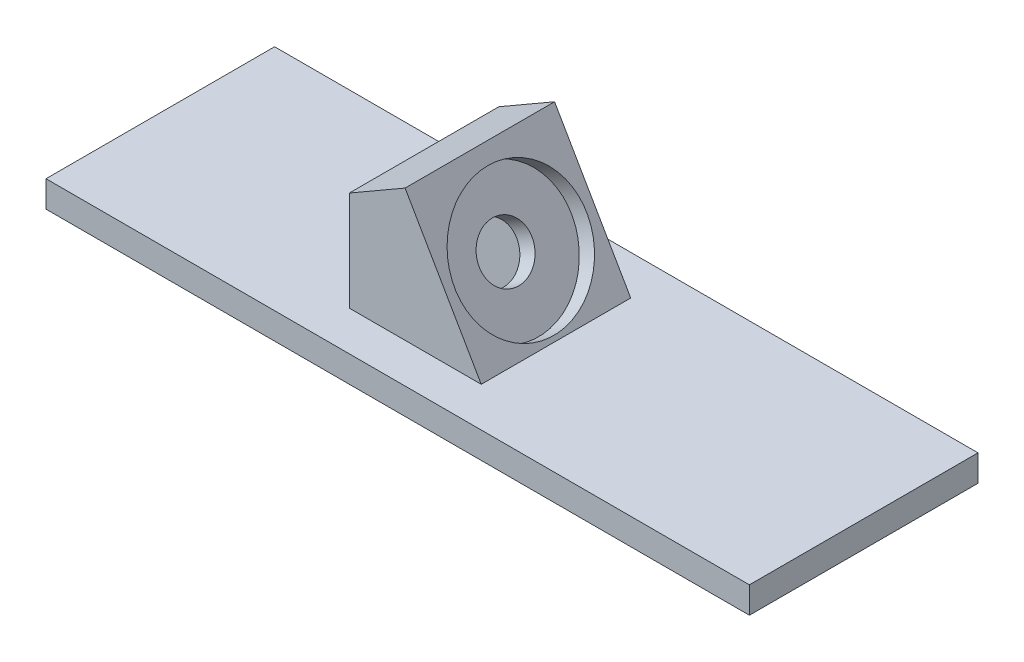
ISO-10303-21;
HEADER;
FILE_DESCRIPTION(('STEP AP214'),'2;1');
FILE_NAME('part.step','',(''),(''),'','','');
FILE_SCHEMA(('AUTOMOTIVE_DESIGN { 1 0 10303 214 1 1 1 1 }'));
ENDSEC;
DATA;
#1=APPLICATION_CONTEXT('core data for automotive mechanical design processes');
#2=APPLICATION_PROTOCOL_DEFINITION('international standard','automotive_design',2000,#1);
#3=PRODUCT_CONTEXT('',#1,'mechanical');
#4=PRODUCT('Part','Part','',(#3));
#5=PRODUCT_RELATED_PRODUCT_CATEGORY('part','',(#4));
#6=PRODUCT_DEFINITION_FORMATION('','',#4);
#7=PRODUCT_DEFINITION_CONTEXT('part definition',#1,'design');
#8=PRODUCT_DEFINITION('design','',#6,#7);
#9=PRODUCT_DEFINITION_SHAPE('','',#8);
#10=(LENGTH_UNIT() NAMED_UNIT(*) SI_UNIT(.MILLI.,.METRE.));
#11=(NAMED_UNIT(*) PLANE_ANGLE_UNIT() SI_UNIT($,.RADIAN.));
#12=(NAMED_UNIT(*) SI_UNIT($,.STERADIAN.) SOLID_ANGLE_UNIT());
#13=UNCERTAINTY_MEASURE_WITH_UNIT(LENGTH_MEASURE(1.E-05),#10,'distance_accuracy_value','');
#14=(GEOMETRIC_REPRESENTATION_CONTEXT(3) GLOBAL_UNCERTAINTY_ASSIGNED_CONTEXT((#13)) GLOBAL_UNIT_ASSIGNED_CONTEXT((#10,
#11,#12)) REPRESENTATION_CONTEXT('',''));
#15=CARTESIAN_POINT('',(0.,0.,0.));
#16=DIRECTION('',(0.,0.,1.));
#17=DIRECTION('',(1.,0.,0.));
#18=AXIS2_PLACEMENT_3D('',#15,#16,#17);
#19=CARTESIAN_POINT('',(0.,15.,0.));
#20=DIRECTION('',(0.,1.,0.));
#21=DIRECTION('',(0.,0.,1.));
#22=AXIS2_PLACEMENT_3D('',#19,#20,#21);
#23=PLANE('',#22);
#24=DIRECTION('',(-1.,0.,0.));
#25=VECTOR('',#24,1.);
#26=CARTESIAN_POINT('',(0.,15.,-11.4479067731796));
#27=LINE('',#26,#25);
#28=CARTESIAN_POINT('',(9.63307260253866,15.,-11.4479067731796));
#29=VERTEX_POINT('',#28);
#30=CARTESIAN_POINT('',(9.62196560360838,15.,-11.4479067731796));
#31=VERTEX_POINT('',#30);
#32=EDGE_CURVE('E194',#29,#31,#27,.T.);
#33=ORIENTED_EDGE('',*,*,#32,.F.);
#34=DIRECTION('',(0.,0.,1.));
#35=VECTOR('',#34,1.);
#36=CARTESIAN_POINT('',(9.63307260253866,15.,-15.6979067731796));
#37=LINE('',#36,#35);
#38=CARTESIAN_POINT('',(9.63307260253866,15.,-15.6979067731796));
#39=VERTEX_POINT('',#38);
#40=EDGE_CURVE('E218',#39,#29,#37,.T.);
#41=ORIENTED_EDGE('',*,*,#40,.F.);
#42=DIRECTION('',(-1.,0.,0.));
#43=VECTOR('',#42,1.);
#44=CARTESIAN_POINT('',(9.63307260253866,15.,-15.6979067731796));
#45=LINE('',#44,#43);
#46=CARTESIAN_POINT('',(24.6330726025387,15.,-15.6979067731796));
#47=VERTEX_POINT('',#46);
#48=EDGE_CURVE('E224',#47,#39,#45,.T.);
#49=ORIENTED_EDGE('',*,*,#48,.F.);
#50=DIRECTION('',(0.,0.,-1.));
#51=VECTOR('',#50,1.);
#52=CARTESIAN_POINT('',(24.6330726025387,15.,-15.6979067731796));
#53=LINE('',#52,#51);
#54=CARTESIAN_POINT('',(24.6330726025387,15.,1.30209322682037));
#55=VERTEX_POINT('',#54);
#56=EDGE_CURVE('E170',#55,#47,#53,.T.);
#57=ORIENTED_EDGE('',*,*,#56,.F.);
#58=DIRECTION('',(1.,0.,0.));
#59=VECTOR('',#58,1.);
#60=CARTESIAN_POINT('',(9.63307260253866,15.,1.30209322682037));
#61=LINE('',#60,#59);
#62=CARTESIAN_POINT('',(9.63307260253866,15.,1.30209322682037));
#63=VERTEX_POINT('',#62);
#64=EDGE_CURVE('E221',#63,#55,#61,.T.);
#65=ORIENTED_EDGE('',*,*,#64,.F.);
#66=CARTESIAN_POINT('',(9.63307260253866,15.,-2.94790677317963));
#67=VERTEX_POINT('',#66);
#68=EDGE_CURVE('E215',#67,#63,#37,.T.);
#69=ORIENTED_EDGE('',*,*,#68,.F.);
#70=DIRECTION('',(1.,0.,0.));
#71=VECTOR('',#70,1.);
#72=CARTESIAN_POINT('',(0.,15.,-2.94790677317963));
#73=LINE('',#72,#71);
#74=CARTESIAN_POINT('',(9.62196560360838,15.,-2.94790677317963));
#75=VERTEX_POINT('',#74);
#76=EDGE_CURVE('E519',#75,#67,#73,.T.);
#77=ORIENTED_EDGE('',*,*,#76,.F.);
#78=DIRECTION('',(0.,0.,-1.));
#79=VECTOR('',#78,1.);
#80=CARTESIAN_POINT('',(9.62196560360838,15.,0.));
#81=LINE('',#80,#79);
#82=EDGE_CURVE('E201',#75,#31,#81,.T.);
#83=ORIENTED_EDGE('',*,*,#82,.T.);
#84=EDGE_LOOP('',(#33,#41,#49,#57,#65,#69,#77,#83));
#85=FACE_BOUND('',#84,.T.);
#86=DIRECTION('',(0.,0.,1.));
#87=VECTOR('',#86,1.);
#88=CARTESIAN_POINT('',(-20.3669273974613,15.,-20.1979067731796));
#89=LINE('',#88,#87);
#90=CARTESIAN_POINT('',(-20.3669273974613,15.,-20.1979067731796));
#91=VERTEX_POINT('',#90);
#92=CARTESIAN_POINT('',(-20.3669273974613,15.,5.80209317830769));
#93=VERTEX_POINT('',#92);
#94=EDGE_CURVE('E230',#91,#93,#89,.T.);
#95=ORIENTED_EDGE('',*,*,#94,.T.);
#96=DIRECTION('',(1.,0.,0.));
#97=VECTOR('',#96,1.);
#98=CARTESIAN_POINT('',(-20.3669273974613,15.,5.80209317830769));
#99=LINE('',#98,#97);
#100=CARTESIAN_POINT('',(59.6315787523036,15.,5.80209317830769));
#101=VERTEX_POINT('',#100);
#102=EDGE_CURVE('E233',#93,#101,#99,.T.);
#103=ORIENTED_EDGE('',*,*,#102,.T.);
#104=DIRECTION('',(0.,0.,-1.));
#105=VECTOR('',#104,1.);
#106=CARTESIAN_POINT('',(59.6315787523036,15.,-20.1979067731796));
#107=LINE('',#106,#105);
#108=CARTESIAN_POINT('',(59.6315787523036,15.,-20.1979067731796));
#109=VERTEX_POINT('',#108);
#110=EDGE_CURVE('E236',#101,#109,#107,.T.);
#111=ORIENTED_EDGE('',*,*,#110,.T.);
#112=DIRECTION('',(-1.,0.,0.));
#113=VECTOR('',#112,1.);
#114=CARTESIAN_POINT('',(-20.3669273974613,15.,-20.1979067731796));
#115=LINE('',#114,#113);
#116=EDGE_CURVE('E238',#109,#91,#115,.T.);
#117=ORIENTED_EDGE('',*,*,#116,.T.);
#118=EDGE_LOOP('',(#95,#103,#111,#117));
#119=FACE_BOUND('',#118,.T.);
#120=ADVANCED_FACE('F33',(#85,#119),#23,.T.);
#121=CARTESIAN_POINT('',(0.,12.,0.));
#122=DIRECTION('',(0.,1.,0.));
#123=DIRECTION('',(0.,0.,1.));
#124=AXIS2_PLACEMENT_3D('',#121,#122,#123);
#125=PLANE('',#124);
#126=DIRECTION('',(0.,0.,-1.));
#127=VECTOR('',#126,1.);
#128=CARTESIAN_POINT('',(59.6315787523036,12.,-20.1979067731796));
#129=LINE('',#128,#127);
#130=CARTESIAN_POINT('',(59.6315787523036,12.,5.80209317830769));
#131=VERTEX_POINT('',#130);
#132=CARTESIAN_POINT('',(59.6315787523036,12.,-20.1979067731796));
#133=VERTEX_POINT('',#132);
#134=EDGE_CURVE('E244',#131,#133,#129,.T.);
#135=ORIENTED_EDGE('',*,*,#134,.F.);
#136=DIRECTION('',(1.,0.,0.));
#137=VECTOR('',#136,1.);
#138=CARTESIAN_POINT('',(-20.3669273974613,12.,5.80209317830769));
#139=LINE('',#138,#137);
#140=CARTESIAN_POINT('',(-20.3669273974613,12.,5.80209317830769));
#141=VERTEX_POINT('',#140);
#142=EDGE_CURVE('E242',#141,#131,#139,.T.);
#143=ORIENTED_EDGE('',*,*,#142,.F.);
#144=DIRECTION('',(0.,0.,1.));
#145=VECTOR('',#144,1.);
#146=CARTESIAN_POINT('',(-20.3669273974613,12.,-20.1979067731796));
#147=LINE('',#146,#145);
#148=CARTESIAN_POINT('',(-20.3669273974613,12.,-20.1979067731796));
#149=VERTEX_POINT('',#148);
#150=EDGE_CURVE('E229',#149,#141,#147,.T.);
#151=ORIENTED_EDGE('',*,*,#150,.F.);
#152=DIRECTION('',(-1.,0.,0.));
#153=VECTOR('',#152,1.);
#154=CARTESIAN_POINT('',(-20.3669273974613,12.,-20.1979067731796));
#155=LINE('',#154,#153);
#156=EDGE_CURVE('E234',#133,#149,#155,.T.);
#157=ORIENTED_EDGE('',*,*,#156,.F.);
#158=EDGE_LOOP('',(#135,#143,#151,#157));
#159=FACE_BOUND('',#158,.T.);
#160=DIRECTION('',(0.,0.,-1.));
#161=VECTOR('',#160,1.);
#162=CARTESIAN_POINT('',(21.7463212565905,12.,0.));
#163=LINE('',#162,#161);
#164=CARTESIAN_POINT('',(21.7463212565905,12.,-2.95726958175604));
#165=VERTEX_POINT('',#164);
#166=CARTESIAN_POINT('',(21.7463212565905,12.,-11.4479067731796));
#167=VERTEX_POINT('',#166);
#168=EDGE_CURVE('E200',#165,#167,#163,.T.);
#169=ORIENTED_EDGE('',*,*,#168,.T.);
#170=DIRECTION('',(-1.,0.,0.));
#171=VECTOR('',#170,1.);
#172=CARTESIAN_POINT('',(0.,12.,-11.4479067731796));
#173=LINE('',#172,#171);
#174=CARTESIAN_POINT('',(11.3540164111772,12.,-11.4479067731796));
#175=VERTEX_POINT('',#174);
#176=EDGE_CURVE('E191',#167,#175,#173,.T.);
#177=ORIENTED_EDGE('',*,*,#176,.T.);
#178=DIRECTION('',(0.,0.,-1.));
#179=VECTOR('',#178,1.);
#180=CARTESIAN_POINT('',(11.3540164111772,12.,0.));
#181=LINE('',#180,#179);
#182=CARTESIAN_POINT('',(11.3540164111772,12.,-2.94790677317963));
#183=VERTEX_POINT('',#182);
#184=EDGE_CURVE('E41',#183,#175,#181,.T.);
#185=ORIENTED_EDGE('',*,*,#184,.F.);
#186=DIRECTION('',(1.,0.,0.));
#187=VECTOR('',#186,1.);
#188=CARTESIAN_POINT('',(0.,12.,-2.94790677317963));
#189=LINE('',#188,#187);
#190=CARTESIAN_POINT('',(11.936920179832,12.,-2.94790677317963));
#191=VERTEX_POINT('',#190);
#192=EDGE_CURVE('E205',#183,#191,#189,.T.);
#193=ORIENTED_EDGE('',*,*,#192,.T.);
#194=DIRECTION('',(0.,0.,-1.));
#195=VECTOR('',#194,1.);
#196=CARTESIAN_POINT('',(11.936920179832,12.,0.));
#197=LINE('',#196,#195);
#198=CARTESIAN_POINT('',(11.936920179832,12.,-2.95726958175604));
#199=VERTEX_POINT('',#198);
#200=EDGE_CURVE('E11',#191,#199,#197,.T.);
#201=ORIENTED_EDGE('',*,*,#200,.T.);
#202=DIRECTION('',(1.,0.,0.));
#203=VECTOR('',#202,1.);
#204=CARTESIAN_POINT('',(0.,12.,-2.95726958175604));
#205=LINE('',#204,#203);
#206=EDGE_CURVE('E502',#199,#165,#205,.T.);
#207=ORIENTED_EDGE('',*,*,#206,.T.);
#208=EDGE_LOOP('',(#169,#177,#185,#193,#201,#207));
#209=FACE_BOUND('',#208,.T.);
#210=ADVANCED_FACE('F198',(#159,#209),#125,.F.);
#211=CARTESIAN_POINT('',(-20.3669273974613,15.,-20.1979067731796));
#212=DIRECTION('',(1.,0.,0.));
#213=DIRECTION('',(0.,0.,-1.));
#214=AXIS2_PLACEMENT_3D('',#211,#212,#213);
#215=PLANE('',#214);
#216=ORIENTED_EDGE('',*,*,#150,.T.);
#217=DIRECTION('',(0.,-1.,0.));
#218=VECTOR('',#217,1.);
#219=CARTESIAN_POINT('',(-20.3669273974613,15.,5.80209317830769));
#220=LINE('',#219,#218);
#221=EDGE_CURVE('E158',#93,#141,#220,.T.);
#222=ORIENTED_EDGE('',*,*,#221,.F.);
#223=ORIENTED_EDGE('',*,*,#94,.F.);
#224=DIRECTION('',(0.,-1.,0.));
#225=VECTOR('',#224,1.);
#226=CARTESIAN_POINT('',(-20.3669273974613,15.,-20.1979067731796));
#227=LINE('',#226,#225);
#228=EDGE_CURVE('E240',#91,#149,#227,.T.);
#229=ORIENTED_EDGE('',*,*,#228,.T.);
#230=EDGE_LOOP('',(#216,#222,#223,#229));
#231=FACE_BOUND('',#230,.T.);
#232=ADVANCED_FACE('F262',(#231),#215,.F.);
#233=CARTESIAN_POINT('',(-20.3669273974613,15.,5.80209317830769));
#234=DIRECTION('',(0.,0.,-1.));
#235=DIRECTION('',(-1.,0.,0.));
#236=AXIS2_PLACEMENT_3D('',#233,#234,#235);
#237=PLANE('',#236);
#238=ORIENTED_EDGE('',*,*,#142,.T.);
#239=DIRECTION('',(0.,-1.,0.));
#240=VECTOR('',#239,1.);
#241=CARTESIAN_POINT('',(59.6315787523036,15.,5.80209317830769));
#242=LINE('',#241,#240);
#243=EDGE_CURVE('E252',#101,#131,#242,.T.);
#244=ORIENTED_EDGE('',*,*,#243,.F.);
#245=ORIENTED_EDGE('',*,*,#102,.F.);
#246=ORIENTED_EDGE('',*,*,#221,.T.);
#247=EDGE_LOOP('',(#238,#244,#245,#246));
#248=FACE_BOUND('',#247,.T.);
#249=ADVANCED_FACE('F257',(#248),#237,.F.);
#250=CARTESIAN_POINT('',(59.6315787523036,15.,-20.1979067731796));
#251=DIRECTION('',(-1.,0.,0.));
#252=DIRECTION('',(0.,0.,1.));
#253=AXIS2_PLACEMENT_3D('',#250,#251,#252);
#254=PLANE('',#253);
#255=ORIENTED_EDGE('',*,*,#134,.T.);
#256=DIRECTION('',(0.,-1.,0.));
#257=VECTOR('',#256,1.);
#258=CARTESIAN_POINT('',(59.6315787523036,15.,-20.1979067731796));
#259=LINE('',#258,#257);
#260=EDGE_CURVE('E249',#109,#133,#259,.T.);
#261=ORIENTED_EDGE('',*,*,#260,.F.);
#262=ORIENTED_EDGE('',*,*,#110,.F.);
#263=ORIENTED_EDGE('',*,*,#243,.T.);
#264=EDGE_LOOP('',(#255,#261,#262,#263));
#265=FACE_BOUND('',#264,.T.);
#266=ADVANCED_FACE('F270',(#265),#254,.F.);
#267=CARTESIAN_POINT('',(-20.3669273974613,15.,-20.1979067731796));
#268=DIRECTION('',(0.,0.,1.));
#269=DIRECTION('',(1.,0.,0.));
#270=AXIS2_PLACEMENT_3D('',#267,#268,#269);
#271=PLANE('',#270);
#272=ORIENTED_EDGE('',*,*,#156,.T.);
#273=ORIENTED_EDGE('',*,*,#228,.F.);
#274=ORIENTED_EDGE('',*,*,#116,.F.);
#275=ORIENTED_EDGE('',*,*,#260,.T.);
#276=EDGE_LOOP('',(#272,#273,#274,#275));
#277=FACE_BOUND('',#276,.T.);
#278=ADVANCED_FACE('F274',(#277),#271,.F.);
#279=CARTESIAN_POINT('',(9.63307260253866,30.,-15.6979067731796));
#280=DIRECTION('',(1.,0.,0.));
#281=DIRECTION('',(0.,0.,-1.));
#282=AXIS2_PLACEMENT_3D('',#279,#280,#281);
#283=PLANE('',#282);
#284=DIRECTION('',(0.,-1.,0.));
#285=VECTOR('',#284,1.);
#286=CARTESIAN_POINT('',(9.63307260253866,30.,1.30209322682037));
#287=LINE('',#286,#285);
#288=CARTESIAN_POINT('',(9.63307260253866,26.3397459621556,1.30209322682037));
#289=VERTEX_POINT('',#288);
#290=EDGE_CURVE('E227',#289,#63,#287,.T.);
#291=ORIENTED_EDGE('',*,*,#290,.F.);
#292=DIRECTION('',(0.,0.,-1.));
#293=VECTOR('',#292,1.);
#294=CARTESIAN_POINT('',(9.63307260253866,26.3397459621556,-15.6979067731796));
#295=LINE('',#294,#293);
#296=CARTESIAN_POINT('',(9.63307260253866,26.3397459621556,-15.6979067731796));
#297=VERTEX_POINT('',#296);
#298=EDGE_CURVE('E166',#289,#297,#295,.T.);
#299=ORIENTED_EDGE('',*,*,#298,.T.);
#300=DIRECTION('',(0.,-1.,0.));
#301=VECTOR('',#300,1.);
#302=CARTESIAN_POINT('',(9.63307260253866,30.,-15.6979067731796));
#303=LINE('',#302,#301);
#304=EDGE_CURVE('E165',#297,#39,#303,.T.);
#305=ORIENTED_EDGE('',*,*,#304,.T.);
#306=ORIENTED_EDGE('',*,*,#40,.T.);
#307=DIRECTION('',(0.,1.,0.));
#308=VECTOR('',#307,1.);
#309=CARTESIAN_POINT('',(9.63307260253866,30.,-11.4479067731796));
#310=LINE('',#309,#308);
#311=CARTESIAN_POINT('',(9.63307260253866,23.6088111963594,-11.4479067731796));
#312=VERTEX_POINT('',#311);
#313=EDGE_CURVE('E179',#29,#312,#310,.T.);
#314=ORIENTED_EDGE('',*,*,#313,.T.);
#315=DIRECTION('',(0.,0.,-1.));
#316=VECTOR('',#315,1.);
#317=CARTESIAN_POINT('',(9.63307260253866,23.6088111963594,-11.4479067731796));
#318=LINE('',#317,#316);
#319=CARTESIAN_POINT('',(9.63307260253866,23.6088111963594,-2.94790677317963));
#320=VERTEX_POINT('',#319);
#321=EDGE_CURVE('E484',#320,#312,#318,.T.);
#322=ORIENTED_EDGE('',*,*,#321,.F.);
#323=DIRECTION('',(0.,-1.,0.));
#324=VECTOR('',#323,1.);
#325=CARTESIAN_POINT('',(9.63307260253866,30.,-2.94790677317963));
#326=LINE('',#325,#324);
#327=EDGE_CURVE('E173',#320,#67,#326,.T.);
#328=ORIENTED_EDGE('',*,*,#327,.T.);
#329=ORIENTED_EDGE('',*,*,#68,.T.);
#330=EDGE_LOOP('',(#291,#299,#305,#306,#314,#322,#328,#329));
#331=FACE_BOUND('',#330,.T.);
#332=ADVANCED_FACE('F284',(#331),#283,.F.);
#333=CARTESIAN_POINT('',(9.63307260253866,30.,1.30209322682037));
#334=DIRECTION('',(0.,0.,-1.));
#335=DIRECTION('',(-1.,0.,0.));
#336=AXIS2_PLACEMENT_3D('',#333,#334,#335);
#337=PLANE('',#336);
#338=DIRECTION('',(-0.499999999999998,0.86602540378444,0.));
#339=VECTOR('',#338,1.);
#340=CARTESIAN_POINT('',(15.9728185646943,30.,1.30209322682037));
#341=LINE('',#340,#339);
#342=CARTESIAN_POINT('',(15.9728185646942,30.,1.30209322682037));
#343=VERTEX_POINT('',#342);
#344=EDGE_CURVE('E171',#55,#343,#341,.T.);
#345=ORIENTED_EDGE('',*,*,#344,.T.);
#346=DIRECTION('',(0.86602540378444,0.499999999999998,0.));
#347=VECTOR('',#346,1.);
#348=CARTESIAN_POINT('',(7.31256452684986,25.,1.30209322682037));
#349=LINE('',#348,#347);
#350=EDGE_CURVE('E152',#289,#343,#349,.T.);
#351=ORIENTED_EDGE('',*,*,#350,.F.);
#352=ORIENTED_EDGE('',*,*,#290,.T.);
#353=ORIENTED_EDGE('',*,*,#64,.T.);
#354=EDGE_LOOP('',(#345,#351,#352,#353));
#355=FACE_BOUND('',#354,.T.);
#356=ADVANCED_FACE('F316',(#355),#337,.F.);
#357=CARTESIAN_POINT('',(9.63307260253866,30.,-15.6979067731796));
#358=DIRECTION('',(0.,0.,1.));
#359=DIRECTION('',(1.,0.,0.));
#360=AXIS2_PLACEMENT_3D('',#357,#358,#359);
#361=PLANE('',#360);
#362=ORIENTED_EDGE('',*,*,#304,.F.);
#363=DIRECTION('',(0.86602540378444,0.499999999999998,0.));
#364=VECTOR('',#363,1.);
#365=CARTESIAN_POINT('',(7.31256452684987,25.,-15.6979067731796));
#366=LINE('',#365,#364);
#367=CARTESIAN_POINT('',(15.9728185646943,30.,-15.6979067731796));
#368=VERTEX_POINT('',#367);
#369=EDGE_CURVE('E149',#297,#368,#366,.T.);
#370=ORIENTED_EDGE('',*,*,#369,.T.);
#371=DIRECTION('',(0.499999999999998,-0.86602540378444,0.));
#372=VECTOR('',#371,1.);
#373=CARTESIAN_POINT('',(15.9728185646943,30.,-15.6979067731796));
#374=LINE('',#373,#372);
#375=EDGE_CURVE('E157',#368,#47,#374,.T.);
#376=ORIENTED_EDGE('',*,*,#375,.T.);
#377=ORIENTED_EDGE('',*,*,#48,.T.);
#378=EDGE_LOOP('',(#362,#370,#376,#377));
#379=FACE_BOUND('',#378,.T.);
#380=ADVANCED_FACE('F162',(#379),#361,.F.);
#381=CARTESIAN_POINT('',(15.9728185646943,30.,0.));
#382=DIRECTION('',(0.86602540378444,0.499999999999998,0.));
#383=DIRECTION('',(0.,0.,1.));
#384=AXIS2_PLACEMENT_3D('',#381,#382,#383);
#385=PLANE('',#384);
#386=CARTESIAN_POINT('',(20.6330726025386,21.9282032302755,-7.19790677317963));
#387=DIRECTION('',(0.86602540378444,0.499999999999998,0.));
#388=DIRECTION('',(-0.499999999999998,0.86602540378444,0.));
#389=AXIS2_PLACEMENT_3D('',#386,#387,#388);
#390=CIRCLE('',#389,7.5);
#391=CARTESIAN_POINT('',(16.8830726025387,28.4233937586588,-7.19790677317963));
#392=VERTEX_POINT('',#391);
#393=EDGE_CURVE('E211',#392,#392,#390,.T.);
#394=ORIENTED_EDGE('',*,*,#393,.F.);
#395=EDGE_LOOP('',(#394));
#396=FACE_BOUND('',#395,.T.);
#397=ORIENTED_EDGE('',*,*,#344,.F.);
#398=ORIENTED_EDGE('',*,*,#56,.T.);
#399=ORIENTED_EDGE('',*,*,#375,.F.);
#400=DIRECTION('',(0.,0.,-1.));
#401=VECTOR('',#400,1.);
#402=CARTESIAN_POINT('',(15.9728185646943,30.,-15.6979067731796));
#403=LINE('',#402,#401);
#404=EDGE_CURVE('E146',#343,#368,#403,.T.);
#405=ORIENTED_EDGE('',*,*,#404,.F.);
#406=EDGE_LOOP('',(#397,#398,#399,#405));
#407=FACE_BOUND('',#406,.T.);
#408=ADVANCED_FACE('F35',(#396,#407),#385,.T.);
#409=CARTESIAN_POINT('',(18.9010217949698,20.9282032302755,-7.19790677317963));
#410=DIRECTION('',(0.86602540378444,0.499999999999998,0.));
#411=DIRECTION('',(-0.499999999999998,0.86602540378444,0.));
#412=AXIS2_PLACEMENT_3D('',#409,#410,#411);
#413=CYLINDRICAL_SURFACE('',#412,7.5);
#414=CARTESIAN_POINT('',(18.9010217949698,20.9282032302755,-7.19790677317963));
#415=DIRECTION('',(0.86602540378444,0.499999999999998,0.));
#416=DIRECTION('',(-0.499999999999998,0.86602540378444,0.));
#417=AXIS2_PLACEMENT_3D('',#414,#415,#416);
#418=CIRCLE('',#417,7.5);
#419=CARTESIAN_POINT('',(15.1510217949698,27.4233937586588,-7.19790677317963));
#420=VERTEX_POINT('',#419);
#421=EDGE_CURVE('E212',#420,#420,#418,.T.);
#422=CARTESIAN_POINT('',(15.1510217949698,27.4233937586588,-7.19790677317963));
#423=CARTESIAN_POINT('',(15.169063990882,27.4338104253255,-7.19790677317963));
#424=CARTESIAN_POINT('',(15.1871061867941,27.4442270919921,-7.19790677317963));
#425=CARTESIAN_POINT('',(15.2231905786185,27.4650604253255,-7.19790677317963));
#426=CARTESIAN_POINT('',(15.2412327745307,27.4754770919921,-7.19790677317963));
#427=CARTESIAN_POINT('',(15.277317166355,27.4963104253255,-7.19790677317963));
#428=CARTESIAN_POINT('',(15.2953593622672,27.5067270919921,-7.19790677317963));
#429=CARTESIAN_POINT('',(15.3314437540915,27.5275604253255,-7.19790677317963));
#430=CARTESIAN_POINT('',(15.3494859500037,27.5379770919921,-7.19790677317963));
#431=CARTESIAN_POINT('',(15.3855703418281,27.5588104253255,-7.19790677317963));
#432=CARTESIAN_POINT('',(15.4036125377402,27.5692270919921,-7.19790677317963));
#433=CARTESIAN_POINT('',(15.4396969295646,27.5900604253255,-7.19790677317963));
#434=CARTESIAN_POINT('',(15.4577391254768,27.6004770919921,-7.19790677317963));
#435=CARTESIAN_POINT('',(15.4938235173011,27.6213104253255,-7.19790677317963));
#436=CARTESIAN_POINT('',(15.5118657132133,27.6317270919921,-7.19790677317963));
#437=CARTESIAN_POINT('',(15.5479501050376,27.6525604253255,-7.19790677317963));
#438=CARTESIAN_POINT('',(15.5659923009498,27.6629770919921,-7.19790677317963));
#439=CARTESIAN_POINT('',(15.6020766927742,27.6838104253255,-7.19790677317963));
#440=CARTESIAN_POINT('',(15.6201188886863,27.6942270919921,-7.19790677317963));
#441=CARTESIAN_POINT('',(15.6562032805107,27.7150604253255,-7.19790677317963));
#442=CARTESIAN_POINT('',(15.6742454764229,27.7254770919921,-7.19790677317963));
#443=CARTESIAN_POINT('',(15.7103298682472,27.7463104253255,-7.19790677317963));
#444=CARTESIAN_POINT('',(15.7283720641594,27.7567270919921,-7.19790677317963));
#445=CARTESIAN_POINT('',(15.7644564559838,27.7775604253255,-7.19790677317963));
#446=CARTESIAN_POINT('',(15.7824986518959,27.7879770919921,-7.19790677317963));
#447=CARTESIAN_POINT('',(15.8185830437203,27.8088104253255,-7.19790677317963));
#448=CARTESIAN_POINT('',(15.8366252396325,27.8192270919921,-7.19790677317963));
#449=CARTESIAN_POINT('',(15.8727096314568,27.8400604253255,-7.19790677317963));
#450=CARTESIAN_POINT('',(15.890751827369,27.8504770919921,-7.19790677317963));
#451=CARTESIAN_POINT('',(15.9268362191933,27.8713104253255,-7.19790677317963));
#452=CARTESIAN_POINT('',(15.9448784151055,27.8817270919921,-7.19790677317963));
#453=CARTESIAN_POINT('',(15.9809628069299,27.9025604253255,-7.19790677317963));
#454=CARTESIAN_POINT('',(15.999005002842,27.9129770919921,-7.19790677317963));
#455=CARTESIAN_POINT('',(16.0350893946664,27.9338104253255,-7.19790677317963));
#456=CARTESIAN_POINT('',(16.0531315905786,27.9442270919921,-7.19790677317963));
#457=CARTESIAN_POINT('',(16.0892159824029,27.9650604253255,-7.19790677317963));
#458=CARTESIAN_POINT('',(16.1072581783151,27.9754770919921,-7.19790677317963));
#459=CARTESIAN_POINT('',(16.1433425701394,27.9963104253255,-7.19790677317963));
#460=CARTESIAN_POINT('',(16.1613847660516,28.0067270919921,-7.19790677317963));
#461=CARTESIAN_POINT('',(16.197469157876,28.0275604253255,-7.19790677317963));
#462=CARTESIAN_POINT('',(16.2155113537881,28.0379770919921,-7.19790677317963));
#463=CARTESIAN_POINT('',(16.2515957456125,28.0588104253255,-7.19790677317963));
#464=CARTESIAN_POINT('',(16.2696379415247,28.0692270919921,-7.19790677317963));
#465=CARTESIAN_POINT('',(16.305722333349,28.0900604253255,-7.19790677317963));
#466=CARTESIAN_POINT('',(16.3237645292612,28.1004770919921,-7.19790677317963));
#467=CARTESIAN_POINT('',(16.3598489210856,28.1213104253255,-7.19790677317963));
#468=CARTESIAN_POINT('',(16.3778911169977,28.1317270919921,-7.19790677317963));
#469=CARTESIAN_POINT('',(16.4139755088221,28.1525604253255,-7.19790677317963));
#470=CARTESIAN_POINT('',(16.4320177047343,28.1629770919921,-7.19790677317963));
#471=CARTESIAN_POINT('',(16.4681020965586,28.1838104253255,-7.19790677317963));
#472=CARTESIAN_POINT('',(16.4861442924708,28.1942270919921,-7.19790677317963));
#473=CARTESIAN_POINT('',(16.5222286842951,28.2150604253255,-7.19790677317963));
#474=CARTESIAN_POINT('',(16.5402708802073,28.2254770919921,-7.19790677317963));
#475=CARTESIAN_POINT('',(16.5763552720317,28.2463104253255,-7.19790677317963));
#476=CARTESIAN_POINT('',(16.5943974679438,28.2567270919921,-7.19790677317963));
#477=CARTESIAN_POINT('',(16.6304818597682,28.2775604253255,-7.19790677317963));
#478=CARTESIAN_POINT('',(16.6485240556804,28.2879770919921,-7.19790677317963));
#479=CARTESIAN_POINT('',(16.6846084475047,28.3088104253255,-7.19790677317963));
#480=CARTESIAN_POINT('',(16.7026506434169,28.3192270919921,-7.19790677317963));
#481=CARTESIAN_POINT('',(16.7387350352412,28.3400604253255,-7.19790677317963));
#482=CARTESIAN_POINT('',(16.7567772311534,28.3504770919921,-7.19790677317963));
#483=CARTESIAN_POINT('',(16.7928616229778,28.3713104253255,-7.19790677317963));
#484=CARTESIAN_POINT('',(16.81090381889,28.3817270919921,-7.19790677317963));
#485=CARTESIAN_POINT('',(16.8469882107143,28.4025604253255,-7.19790677317963));
#486=CARTESIAN_POINT('',(16.8650304066265,28.4129770919921,-7.19790677317963));
#487=CARTESIAN_POINT('',(16.8830726025387,28.4233937586588,-7.19790677317963));
#488=B_SPLINE_CURVE_WITH_KNOTS('',3,(#422,#423,#424,#425,#426,#427,#428,#429,#430,#431,#432,
#433,#434,#435,#436,#437,#438,#439,#440,#441,#442,#443,#444,#445,#446,#447,#448,#449,#450,#451,
#452,#453,#454,#455,#456,#457,#458,#459,#460,#461,#462,#463,#464,#465,#466,#467,#468,#469,#470,
#471,#472,#473,#474,#475,#476,#477,#478,#479,#480,#481,#482,#483,#484,#485,#486,#487),
.UNSPECIFIED.,.F.,.F.,(4,2,2,2,2,2,2,2,2,2,2,2,2,2,2,2,2,2,2,2,2,2,2,2,2,2,2,2,2,2,2,2,4),(0.,
0.0625000000000002,0.125,0.187500000000001,0.250000000000001,0.312500000000001,
0.375000000000001,0.437500000000002,0.500000000000002,0.562500000000002,0.625000000000003,
0.687500000000003,0.750000000000003,0.8125,0.875000000000001,0.937500000000001,1.,1.0625,1.125,
1.1875,1.25,1.3125,1.375,1.4375,1.5,1.5625,1.625,1.6875,1.75,1.8125,1.875,1.9375,2.),.UNSPECIFIED.);
#489=EDGE_CURVE('BSEAM336',#420,#392,#488,.T.);
#490=ORIENTED_EDGE('',*,*,#421,.F.);
#491=ORIENTED_EDGE('',*,*,#393,.T.);
#492=ORIENTED_EDGE('',*,*,#489,.T.);
#493=ORIENTED_EDGE('',*,*,#489,.F.);
#494=EDGE_LOOP('',(#490,#492,#491,#493));
#495=FACE_BOUND('',#494,.T.);
#496=ADVANCED_FACE('F336',(#495),#413,.F.);
#497=CARTESIAN_POINT('',(18.9010217949698,20.9282032302755,-7.19790677317963));
#498=DIRECTION('',(0.86602540378444,0.499999999999998,0.));
#499=DIRECTION('',(-0.499999999999998,0.86602540378444,0.));
#500=AXIS2_PLACEMENT_3D('',#497,#498,#499);
#501=PLANE('',#500);
#502=CARTESIAN_POINT('',(18.9010217949698,20.9282032302755,-7.19790677317963));
#503=DIRECTION('',(0.86602540378444,0.499999999999998,0.));
#504=DIRECTION('',(-0.499999999999998,0.86602540378444,0.));
#505=AXIS2_PLACEMENT_3D('',#502,#503,#504);
#506=CIRCLE('',#505,3.);
#507=CARTESIAN_POINT('',(17.4010217949698,23.5262794416288,-7.19790677317963));
#508=VERTEX_POINT('',#507);
#509=EDGE_CURVE('E203',#508,#508,#506,.T.);
#510=ORIENTED_EDGE('',*,*,#509,.F.);
#511=EDGE_LOOP('',(#510));
#512=FACE_BOUND('',#511,.T.);
#513=ORIENTED_EDGE('',*,*,#421,.T.);
#514=EDGE_LOOP('',(#513));
#515=FACE_BOUND('',#514,.T.);
#516=ADVANCED_FACE('F344',(#512,#515),#501,.T.);
#517=CARTESIAN_POINT('',(17.1689709874009,19.9282032302755,-7.19790677317963));
#518=DIRECTION('',(0.86602540378444,0.499999999999998,0.));
#519=DIRECTION('',(-0.499999999999998,0.86602540378444,0.));
#520=AXIS2_PLACEMENT_3D('',#517,#518,#519);
#521=CYLINDRICAL_SURFACE('',#520,3.);
#522=CARTESIAN_POINT('',(17.1689709874009,19.9282032302755,-7.19790677317963));
#523=DIRECTION('',(0.86602540378444,0.499999999999998,0.));
#524=DIRECTION('',(-0.499999999999998,0.86602540378444,0.));
#525=AXIS2_PLACEMENT_3D('',#522,#523,#524);
#526=CIRCLE('',#525,3.);
#527=CARTESIAN_POINT('',(15.6689709874009,22.5262794416288,-7.19790677317963));
#528=VERTEX_POINT('',#527);
#529=EDGE_CURVE('E516',#528,#528,#526,.F.);
#530=ORIENTED_EDGE('',*,*,#529,.T.);
#531=EDGE_LOOP('',(#530));
#532=FACE_BOUND('',#531,.T.);
#533=ORIENTED_EDGE('',*,*,#509,.T.);
#534=EDGE_LOOP('',(#533));
#535=FACE_BOUND('',#534,.T.);
#536=ADVANCED_FACE('F352',(#532,#535),#521,.F.);
#537=CARTESIAN_POINT('',(11.4997423533409,11.7475952641917,-2.94790677317963));
#538=DIRECTION('',(0.499999999999998,-0.86602540378444,0.));
#539=DIRECTION('',(0.86602540378444,0.499999999999998,0.));
#540=AXIS2_PLACEMENT_3D('',#537,#538,#539);
#541=PLANE('',#540);
#542=DIRECTION('',(0.,0.,-1.));
#543=VECTOR('',#542,1.);
#544=CARTESIAN_POINT('',(19.2939709874009,16.2475952641916,-2.94790677317963));
#545=LINE('',#544,#543);
#546=CARTESIAN_POINT('',(19.2939709874009,16.2475952641916,-2.94790677317963));
#547=VERTEX_POINT('',#546);
#548=CARTESIAN_POINT('',(19.2939709874009,16.2475952641916,-2.95726958175604));
#549=VERTEX_POINT('',#548);
#550=EDGE_CURVE('E195',#547,#549,#545,.T.);
#551=ORIENTED_EDGE('',*,*,#550,.T.);
#552=DIRECTION('',(0.866025403784439,0.499999999999999,0.));
#553=VECTOR('',#552,1.);
#554=CARTESIAN_POINT('',(11.936920179832,12.,-2.95726958175604));
#555=LINE('',#554,#553);
#556=EDGE_CURVE('E48',#199,#549,#555,.T.);
#557=ORIENTED_EDGE('',*,*,#556,.F.);
#558=ORIENTED_EDGE('',*,*,#200,.F.);
#559=DIRECTION('',(0.86602540378444,0.499999999999998,0.));
#560=VECTOR('',#559,1.);
#561=CARTESIAN_POINT('',(11.4997423533409,11.7475952641917,-2.94790677317963));
#562=LINE('',#561,#560);
#563=EDGE_CURVE('E507',#191,#547,#562,.T.);
#564=ORIENTED_EDGE('',*,*,#563,.T.);
#565=EDGE_LOOP('',(#551,#557,#558,#564));
#566=FACE_BOUND('',#565,.T.);
#567=ADVANCED_FACE('F359',(#566),#541,.F.);
#568=CARTESIAN_POINT('',(13.7116647310896,7.91643332353242,0.));
#569=DIRECTION('',(0.86602540378444,0.499999999999998,0.));
#570=DIRECTION('',(-0.499999999999998,0.86602540378444,0.));
#571=AXIS2_PLACEMENT_3D('',#568,#569,#570);
#572=PLANE('',#571);
#573=DIRECTION('',(0.499999999999998,-0.86602540378444,0.));
#574=VECTOR('',#573,1.);
#575=CARTESIAN_POINT('',(7.24974235334095,19.1088111963594,-2.94790677317963));
#576=LINE('',#575,#574);
#577=EDGE_CURVE('E56',#75,#183,#576,.T.);
#578=ORIENTED_EDGE('',*,*,#577,.T.);
#579=ORIENTED_EDGE('',*,*,#184,.T.);
#580=DIRECTION('',(-0.499999999999998,0.86602540378444,0.));
#581=VECTOR('',#580,1.);
#582=CARTESIAN_POINT('',(7.24974235334095,19.1088111963594,-11.4479067731796));
#583=LINE('',#582,#581);
#584=EDGE_CURVE('E184',#175,#31,#583,.T.);
#585=ORIENTED_EDGE('',*,*,#584,.T.);
#586=ORIENTED_EDGE('',*,*,#82,.F.);
#587=EDGE_LOOP('',(#578,#579,#585,#586));
#588=FACE_BOUND('',#587,.T.);
#589=ADVANCED_FACE('F183',(#588),#572,.T.);
#590=CARTESIAN_POINT('',(7.24974235334095,19.1088111963594,-11.4479067731796));
#591=DIRECTION('',(0.,0.,-1.));
#592=DIRECTION('',(0.,1.,0.));
#593=AXIS2_PLACEMENT_3D('',#590,#591,#592);
#594=PLANE('',#593);
#595=DIRECTION('',(-0.499999999999998,0.86602540378444,0.));
#596=VECTOR('',#595,1.);
#597=CARTESIAN_POINT('',(15.0439709874009,23.6088111963594,-11.4479067731796));
#598=LINE('',#597,#596);
#599=CARTESIAN_POINT('',(15.0439709874009,23.6088111963594,-11.4479067731796));
#600=VERTEX_POINT('',#599);
#601=EDGE_CURVE('E504',#167,#600,#598,.T.);
#602=ORIENTED_EDGE('',*,*,#601,.T.);
#603=DIRECTION('',(-1.,0.,0.));
#604=VECTOR('',#603,1.);
#605=CARTESIAN_POINT('',(25.7021606520248,23.6088111963594,-11.4479067731796));
#606=LINE('',#605,#604);
#607=EDGE_CURVE('E488',#600,#312,#606,.T.);
#608=ORIENTED_EDGE('',*,*,#607,.T.);
#609=ORIENTED_EDGE('',*,*,#313,.F.);
#610=ORIENTED_EDGE('',*,*,#32,.T.);
#611=ORIENTED_EDGE('',*,*,#584,.F.);
#612=ORIENTED_EDGE('',*,*,#176,.F.);
#613=EDGE_LOOP('',(#602,#608,#609,#610,#611,#612));
#614=FACE_BOUND('',#613,.T.);
#615=ADVANCED_FACE('F190',(#614),#594,.F.);
#616=CARTESIAN_POINT('',(7.24974235334095,19.1088111963594,-2.94790677317963));
#617=DIRECTION('',(0.,0.,1.));
#618=DIRECTION('',(0.,-1.,0.));
#619=AXIS2_PLACEMENT_3D('',#616,#617,#618);
#620=PLANE('',#619);
#621=ORIENTED_EDGE('',*,*,#327,.F.);
#622=DIRECTION('',(-1.,0.,0.));
#623=VECTOR('',#622,1.);
#624=CARTESIAN_POINT('',(25.7021606520248,23.6088111963594,-2.94790677317963));
#625=LINE('',#624,#623);
#626=CARTESIAN_POINT('',(15.0439709874009,23.6088111963594,-2.94790677317963));
#627=VERTEX_POINT('',#626);
#628=EDGE_CURVE('E481',#627,#320,#625,.T.);
#629=ORIENTED_EDGE('',*,*,#628,.F.);
#630=DIRECTION('',(0.499999999999998,-0.86602540378444,0.));
#631=VECTOR('',#630,1.);
#632=CARTESIAN_POINT('',(15.0439709874009,23.6088111963594,-2.94790677317963));
#633=LINE('',#632,#631);
#634=EDGE_CURVE('E510',#627,#547,#633,.T.);
#635=ORIENTED_EDGE('',*,*,#634,.T.);
#636=ORIENTED_EDGE('',*,*,#563,.F.);
#637=ORIENTED_EDGE('',*,*,#192,.F.);
#638=ORIENTED_EDGE('',*,*,#577,.F.);
#639=ORIENTED_EDGE('',*,*,#76,.T.);
#640=EDGE_LOOP('',(#621,#629,#635,#636,#637,#638,#639));
#641=FACE_BOUND('',#640,.T.);
#642=ADVANCED_FACE('F381',(#641),#620,.F.);
#643=CARTESIAN_POINT('',(21.5058933651495,12.4164333235324,0.));
#644=DIRECTION('',(0.86602540378444,0.499999999999998,0.));
#645=DIRECTION('',(-0.499999999999998,0.86602540378444,0.));
#646=AXIS2_PLACEMENT_3D('',#643,#644,#645);
#647=PLANE('',#646);
#648=ORIENTED_EDGE('',*,*,#529,.F.);
#649=EDGE_LOOP('',(#648));
#650=FACE_BOUND('',#649,.T.);
#651=ORIENTED_EDGE('',*,*,#550,.F.);
#652=ORIENTED_EDGE('',*,*,#634,.F.);
#653=DIRECTION('',(0.,0.,1.));
#654=VECTOR('',#653,1.);
#655=CARTESIAN_POINT('',(15.0439709874009,23.6088111963594,-2.94790677317963));
#656=LINE('',#655,#654);
#657=EDGE_CURVE('E486',#600,#627,#656,.T.);
#658=ORIENTED_EDGE('',*,*,#657,.F.);
#659=ORIENTED_EDGE('',*,*,#601,.F.);
#660=ORIENTED_EDGE('',*,*,#168,.F.);
#661=DIRECTION('',(-0.499999999999999,0.86602540378444,0.));
#662=VECTOR('',#661,1.);
#663=CARTESIAN_POINT('',(36.4137943032253,-13.4048085354187,-2.95726958175604));
#664=LINE('',#663,#662);
#665=EDGE_CURVE('E500',#165,#549,#664,.T.);
#666=ORIENTED_EDGE('',*,*,#665,.T.);
#667=EDGE_LOOP('',(#651,#652,#658,#659,#660,#666));
#668=FACE_BOUND('',#667,.T.);
#669=ADVANCED_FACE('F388',(#650,#668),#647,.F.);
#670=CARTESIAN_POINT('',(29.0567434956564,-17.6524037996104,-2.95726958175604));
#671=DIRECTION('',(0.,0.,1.));
#672=DIRECTION('',(1.,0.,0.));
#673=AXIS2_PLACEMENT_3D('',#670,#671,#672);
#674=PLANE('',#673);
#675=ORIENTED_EDGE('',*,*,#556,.T.);
#676=ORIENTED_EDGE('',*,*,#665,.F.);
#677=ORIENTED_EDGE('',*,*,#206,.F.);
#678=EDGE_LOOP('',(#675,#676,#677));
#679=FACE_BOUND('',#678,.T.);
#680=ADVANCED_FACE('F396',(#679),#674,.F.);
#681=CARTESIAN_POINT('',(25.7021606520248,23.6088111963594,-11.4479067731796));
#682=DIRECTION('',(0.,1.,0.));
#683=DIRECTION('',(0.,0.,1.));
#684=AXIS2_PLACEMENT_3D('',#681,#682,#683);
#685=PLANE('',#684);
#686=ORIENTED_EDGE('',*,*,#628,.T.);
#687=ORIENTED_EDGE('',*,*,#321,.T.);
#688=ORIENTED_EDGE('',*,*,#607,.F.);
#689=ORIENTED_EDGE('',*,*,#657,.T.);
#690=EDGE_LOOP('',(#686,#687,#688,#689));
#691=FACE_BOUND('',#690,.T.);
#692=ADVANCED_FACE('F403',(#691),#685,.F.);
#693=CARTESIAN_POINT('',(7.31256452684986,25.,1.30209322682037));
#694=DIRECTION('',(0.499999999999998,-0.86602540378444,0.));
#695=DIRECTION('',(0.86602540378444,0.499999999999998,0.));
#696=AXIS2_PLACEMENT_3D('',#693,#694,#695);
#697=PLANE('',#696);
#698=ORIENTED_EDGE('',*,*,#350,.T.);
#699=ORIENTED_EDGE('',*,*,#404,.T.);
#700=ORIENTED_EDGE('',*,*,#369,.F.);
#701=ORIENTED_EDGE('',*,*,#298,.F.);
#702=EDGE_LOOP('',(#698,#699,#700,#701));
#703=FACE_BOUND('',#702,.T.);
#704=ADVANCED_FACE('F148',(#703),#697,.F.);
#705=CLOSED_SHELL('',(#120,#210,#232,#249,#266,#278,#332,#356,#380,#408,#496,#516,#536,#567,
#589,#615,#642,#669,#680,#692,#704));
#706=MANIFOLD_SOLID_BREP('B2',#705);
#707=ADVANCED_BREP_SHAPE_REPRESENTATION('',(#18,#706),#14);
#708=SHAPE_DEFINITION_REPRESENTATION(#9,#707);
ENDSEC;
END-ISO-10303-21;
